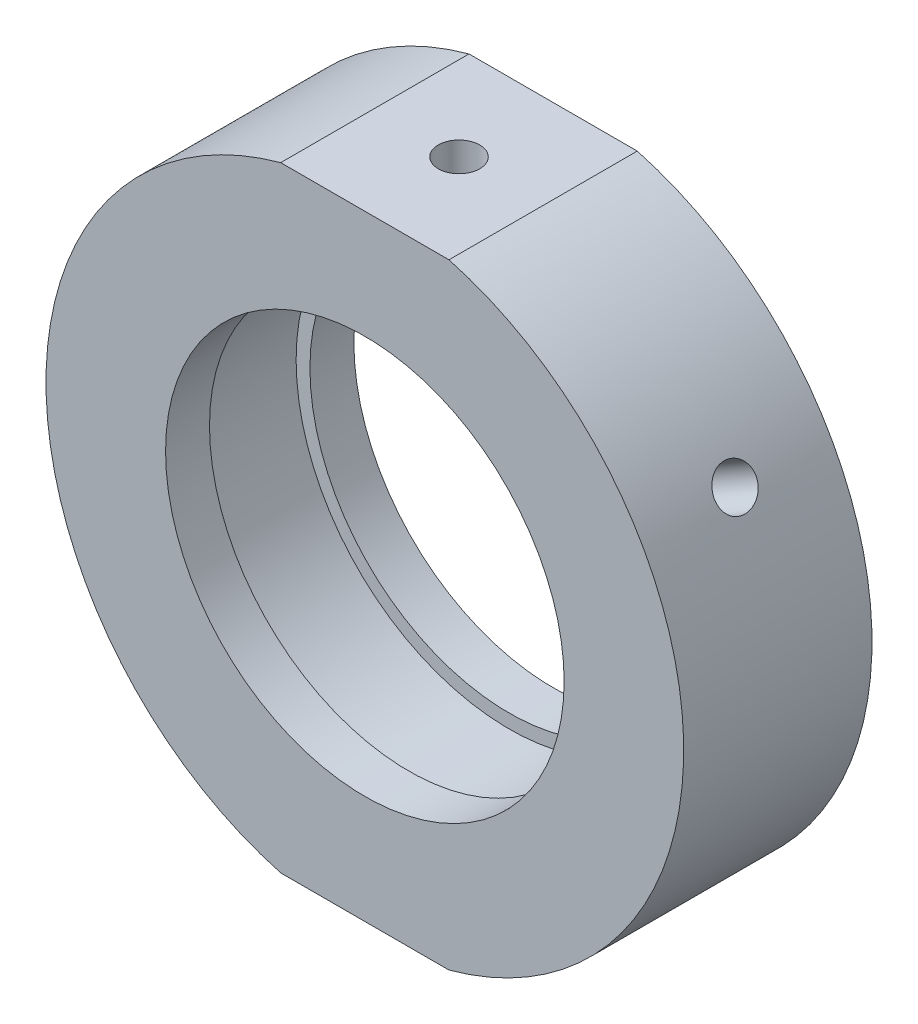
ISO-10303-21;
HEADER;
FILE_DESCRIPTION(('STEP AP214'),'2;1');
FILE_NAME('part.step','',(''),(''),'','','');
FILE_SCHEMA(('AUTOMOTIVE_DESIGN { 1 0 10303 214 1 1 1 1 }'));
ENDSEC;
DATA;
#1=APPLICATION_CONTEXT('core data for automotive mechanical design processes');
#2=APPLICATION_PROTOCOL_DEFINITION('international standard','automotive_design',2000,#1);
#3=PRODUCT_CONTEXT('',#1,'mechanical');
#4=PRODUCT('Part','Part','',(#3));
#5=PRODUCT_RELATED_PRODUCT_CATEGORY('part','',(#4));
#6=PRODUCT_DEFINITION_FORMATION('','',#4);
#7=PRODUCT_DEFINITION_CONTEXT('part definition',#1,'design');
#8=PRODUCT_DEFINITION('design','',#6,#7);
#9=PRODUCT_DEFINITION_SHAPE('','',#8);
#10=(LENGTH_UNIT() NAMED_UNIT(*) SI_UNIT(.MILLI.,.METRE.));
#11=(NAMED_UNIT(*) PLANE_ANGLE_UNIT() SI_UNIT($,.RADIAN.));
#12=(NAMED_UNIT(*) SI_UNIT($,.STERADIAN.) SOLID_ANGLE_UNIT());
#13=UNCERTAINTY_MEASURE_WITH_UNIT(LENGTH_MEASURE(1.E-05),#10,'distance_accuracy_value','');
#14=(GEOMETRIC_REPRESENTATION_CONTEXT(3) GLOBAL_UNCERTAINTY_ASSIGNED_CONTEXT((#13)) GLOBAL_UNIT_ASSIGNED_CONTEXT((#10,
#11,#12)) REPRESENTATION_CONTEXT('',''));
#15=CARTESIAN_POINT('',(0.,0.,0.));
#16=DIRECTION('',(0.,0.,1.));
#17=DIRECTION('',(1.,0.,0.));
#18=AXIS2_PLACEMENT_3D('',#15,#16,#17);
#19=CARTESIAN_POINT('',(0.,0.,-31.9390681003584));
#20=DIRECTION('',(0.,0.,-1.));
#21=DIRECTION('',(-1.,0.,0.));
#22=AXIS2_PLACEMENT_3D('',#19,#20,#21);
#23=CYLINDRICAL_SURFACE('',#22,25.4);
#24=CARTESIAN_POINT('',(21.1255837052229,14.1021173273243,0.));
#25=CARTESIAN_POINT('',(21.1255863615312,14.1021141605083,-0.092576256315231));
#26=CARTESIAN_POINT('',(21.1299363854258,14.0956035641206,-0.18521714935843));
#27=CARTESIAN_POINT('',(21.1471903326474,14.0697041126058,-0.367940352830904));
#28=CARTESIAN_POINT('',(21.1601041850746,14.0503003087446,-0.458019566611404));
#29=CARTESIAN_POINT('',(21.1940041030208,13.9991116481198,-0.632946226853724));
#30=CARTESIAN_POINT('',(21.2149858749936,13.9673333766262,-0.71779642824638));
#31=CARTESIAN_POINT('',(21.2642526004663,13.8922125376661,-0.879890058522677));
#32=CARTESIAN_POINT('',(21.292535893129,13.8488725999941,-0.957135211772866));
#33=CARTESIAN_POINT('',(21.3554466990147,13.7516632788366,-1.1019726091419));
#34=CARTESIAN_POINT('',(21.3900831871358,13.6977789924932,-1.1695509539082));
#35=CARTESIAN_POINT('',(21.4644736584157,13.5809115475335,-1.29301742319575));
#36=CARTESIAN_POINT('',(21.5042278559428,13.5179280077581,-1.3489050577641));
#37=CARTESIAN_POINT('',(21.5875527489257,13.3844593266428,-1.44744666643091));
#38=CARTESIAN_POINT('',(21.631126729652,13.3139677164302,-1.49008910270414));
#39=CARTESIAN_POINT('',(21.7206441675858,13.1674212213743,-1.56085598399379));
#40=CARTESIAN_POINT('',(21.7665875977651,13.0913663999864,-1.58898059457471));
#41=CARTESIAN_POINT('',(21.8593422054505,12.9358933258085,-1.62987480068591));
#42=CARTESIAN_POINT('',(21.906152053296,12.8564800197265,-1.64266621735386));
#43=CARTESIAN_POINT('',(21.9993099582266,12.6964142499021,-1.65259832827393));
#44=CARTESIAN_POINT('',(22.0456580208599,12.6157618010774,-1.64973921079273));
#45=CARTESIAN_POINT('',(22.1365174445638,12.4556436472342,-1.62846939769357));
#46=CARTESIAN_POINT('',(22.1810314715213,12.3761763351589,-1.61008217447344));
#47=CARTESIAN_POINT('',(22.2671217856854,12.2206054060558,-1.55831452801674));
#48=CARTESIAN_POINT('',(22.3086980544109,12.1445018101899,-1.52493401046853));
#49=CARTESIAN_POINT('',(22.3879172153119,11.9978382471997,-1.4441007901877));
#50=CARTESIAN_POINT('',(22.4255571087251,11.9272825164906,-1.39663746316395));
#51=CARTESIAN_POINT('',(22.4960021791464,11.7938791572256,-1.28899366150814));
#52=CARTESIAN_POINT('',(22.5288072972254,11.7310316226231,-1.22881303189206));
#53=CARTESIAN_POINT('',(22.588934021688,11.6148335001785,-1.09731039334049));
#54=CARTESIAN_POINT('',(22.6162453867024,11.5615006700455,-1.02596800882872));
#55=CARTESIAN_POINT('',(22.6647552962459,11.4661126921603,-0.874238356232138));
#56=CARTESIAN_POINT('',(22.685953838128,11.4240575492918,-0.793851084230694));
#57=CARTESIAN_POINT('',(22.7218310998525,11.3525327799725,-0.626300386389155));
#58=CARTESIAN_POINT('',(22.736509412598,11.3230639393646,-0.53913653784588));
#59=CARTESIAN_POINT('',(22.7590714641954,11.2776466843304,-0.360513015415985));
#60=CARTESIAN_POINT('',(22.7669552894322,11.2616980980085,-0.269053396161131));
#61=CARTESIAN_POINT('',(22.7757773944076,11.2438456563849,-0.084613406643308));
#62=CARTESIAN_POINT('',(22.7767283360383,11.2419161972317,0.00836388027156324));
#63=CARTESIAN_POINT('',(22.7717010905697,11.2520958233832,0.193357145884924));
#64=CARTESIAN_POINT('',(22.7657229424632,11.2642048296879,0.285373129990113));
#65=CARTESIAN_POINT('',(22.7469535565592,11.302059325108,0.465751060044093));
#66=CARTESIAN_POINT('',(22.7341682048513,11.3277930330357,0.554116091891322));
#67=CARTESIAN_POINT('',(22.7020224111887,11.3920789365367,0.72477904114321));
#68=CARTESIAN_POINT('',(22.6826619048223,11.4306312576839,0.807076899102928));
#69=CARTESIAN_POINT('',(22.6376996378619,11.5194194964734,0.96340024846482));
#70=CARTESIAN_POINT('',(22.6120888762405,11.5696722591463,1.0374135830307));
#71=CARTESIAN_POINT('',(22.5551499391607,11.6802855429439,1.17494441291504));
#72=CARTESIAN_POINT('',(22.5238217033653,11.7406461707372,1.2384617974554));
#73=CARTESIAN_POINT('',(22.4560577971483,11.8697422229493,1.35329408810745));
#74=CARTESIAN_POINT('',(22.419614533366,11.93849007816,1.4045905409198));
#75=CARTESIAN_POINT('',(22.3424817952513,12.0822245712966,1.49339854031989));
#76=CARTESIAN_POINT('',(22.3017923488145,12.1572111682362,1.53091017746014));
#77=CARTESIAN_POINT('',(22.2171899924813,12.3111400494117,1.59105167185681));
#78=CARTESIAN_POINT('',(22.1732796363469,12.3900791843691,1.6136931803907));
#79=CARTESIAN_POINT('',(22.0833510532279,12.5496609908419,1.64348983344682));
#80=CARTESIAN_POINT('',(22.0373328489618,12.6303036439917,1.6506451448404));
#81=CARTESIAN_POINT('',(21.9445519782846,12.7908255022556,1.64926464318743));
#82=CARTESIAN_POINT('',(21.8977908385922,12.8707058396567,1.64075769659949));
#83=CARTESIAN_POINT('',(21.8048098503978,13.0276086425459,1.60835404670283));
#84=CARTESIAN_POINT('',(21.7585900028295,13.1046311031043,1.584457316849));
#85=CARTESIAN_POINT('',(21.6681118736425,13.2536989678976,1.52195905008008));
#86=CARTESIAN_POINT('',(21.6238535702055,13.3257444274968,1.48335767677136));
#87=CARTESIAN_POINT('',(21.5387155385461,13.4629216075301,1.39254977966906));
#88=CARTESIAN_POINT('',(21.4978357262853,13.5280534999474,1.34034359442331));
#89=CARTESIAN_POINT('',(21.420742973893,13.6497978206802,1.22370103592581));
#90=CARTESIAN_POINT('',(21.3845382072521,13.7063953563964,1.15924371720355));
#91=CARTESIAN_POINT('',(21.3181153252652,13.809479721239,1.0199581955059));
#92=CARTESIAN_POINT('',(21.2878986755489,13.8559640753715,0.945127461168909));
#93=CARTESIAN_POINT('',(21.2344988622279,13.937663029851,0.787127696262785));
#94=CARTESIAN_POINT('',(21.2113249285851,13.9728628443212,0.703947911881443));
#95=CARTESIAN_POINT('',(21.1729283497024,14.0309775009916,0.531749358735033));
#96=CARTESIAN_POINT('',(21.1576964096522,14.0539067047765,0.442737553421856));
#97=CARTESIAN_POINT('',(21.1396971044625,14.0809571867969,0.294319263500426));
#98=CARTESIAN_POINT('',(21.1344131421564,14.0888829299295,0.235871694983986));
#99=CARTESIAN_POINT('',(21.1273555964686,14.0994640080415,0.118291548613022));
#100=CARTESIAN_POINT('',(21.1255820077632,14.1021193510136,0.0591589717974798));
#101=CARTESIAN_POINT('',(21.1255837052229,14.1021173273243,0.));
#102=B_SPLINE_CURVE_WITH_KNOTS('',3,(#24,#25,#26,#27,#28,#29,#30,#31,#32,#33,#34,#35,#36,#37,
#38,#39,#40,#41,#42,#43,#44,#45,#46,#47,#48,#49,#50,#51,#52,#53,#54,#55,#56,#57,#58,#59,#60,#61,
#62,#63,#64,#65,#66,#67,#68,#69,#70,#71,#72,#73,#74,#75,#76,#77,#78,#79,#80,#81,#82,#83,#84,#85,
#86,#87,#88,#89,#90,#91,#92,#93,#94,#95,#96,#97,#98,#99,#100,#101),.UNSPECIFIED.,.T.,.F.,(4,2,2,
2,2,2,2,2,2,2,2,2,2,2,2,2,2,2,2,2,2,2,2,2,2,2,2,2,2,2,2,2,2,2,2,2,2,2,4),(0.,0.277512798480436,
0.55534791555879,0.833035379869694,1.11065973569114,1.38867934350629,1.66671060067618,
1.94498337461715,2.22325297500384,2.50112608945465,2.77899586126354,3.05644635337373,
3.33389859074277,3.61156067692887,3.88922614713995,4.16740453539095,4.44558304409998,
4.72377891872058,5.00197125632302,5.27965538897225,5.55733795898812,5.83478080996282,
6.11222637890522,6.39007388121361,6.66792431583895,6.94619167560211,7.22445720739304,
7.50250444724585,7.78054869098884,8.05808099582016,8.33561377935525,8.61314347510357,
8.89066626534621,9.16866786858889,9.44673743068538,9.7251698658511,10.0032757055969,
10.1806148784034,10.3579537822671),.UNSPECIFIED.);
#103=CARTESIAN_POINT('',(21.1255837052229,14.1021173273243,0.));
#104=VERTEX_POINT('',#103);
#105=EDGE_CURVE('E13',#104,#104,#102,.T.);
#106=ORIENTED_EDGE('',*,*,#105,.T.);
#107=EDGE_LOOP('',(#106));
#108=FACE_BOUND('',#107,.T.);
#109=CARTESIAN_POINT('',(0.,0.,7.49999999999999));
#110=DIRECTION('',(0.,0.,-1.));
#111=DIRECTION('',(-1.,0.,0.));
#112=AXIS2_PLACEMENT_3D('',#109,#110,#111);
#113=CIRCLE('',#112,25.4);
#114=CARTESIAN_POINT('',(6.70149237110661,24.5,7.5));
#115=VERTEX_POINT('',#114);
#116=CARTESIAN_POINT('',(6.70149237110661,-24.5,7.49999999999999));
#117=VERTEX_POINT('',#116);
#118=EDGE_CURVE('E158',#115,#117,#113,.T.);
#119=ORIENTED_EDGE('',*,*,#118,.T.);
#120=DIRECTION('',(0.,0.,-1.));
#121=VECTOR('',#120,1.);
#122=CARTESIAN_POINT('',(6.70149237110663,-24.5,-31.9390681003584));
#123=LINE('',#122,#121);
#124=CARTESIAN_POINT('',(6.7014923711066,-24.5,-7.5));
#125=VERTEX_POINT('',#124);
#126=EDGE_CURVE('E71',#117,#125,#123,.T.);
#127=ORIENTED_EDGE('',*,*,#126,.T.);
#128=CARTESIAN_POINT('',(0.,0.,-7.5));
#129=DIRECTION('',(0.,0.,-1.));
#130=DIRECTION('',(-1.,0.,0.));
#131=AXIS2_PLACEMENT_3D('',#128,#129,#130);
#132=CIRCLE('',#131,25.4);
#133=CARTESIAN_POINT('',(6.70149237110663,24.5,-7.5));
#134=VERTEX_POINT('',#133);
#135=EDGE_CURVE('E162',#134,#125,#132,.T.);
#136=ORIENTED_EDGE('',*,*,#135,.F.);
#137=DIRECTION('',(0.,0.,-1.));
#138=VECTOR('',#137,1.);
#139=CARTESIAN_POINT('',(6.70149237110663,24.5,-31.9390681003584));
#140=LINE('',#139,#138);
#141=EDGE_CURVE('E132',#134,#115,#140,.F.);
#142=ORIENTED_EDGE('',*,*,#141,.T.);
#143=EDGE_LOOP('',(#119,#127,#136,#142));
#144=FACE_BOUND('',#143,.T.);
#145=ADVANCED_FACE('F51',(#108,#144),#23,.T.);
#146=CARTESIAN_POINT('',(15.875,0.,-7.5));
#147=DIRECTION('',(0.,0.,1.));
#148=DIRECTION('',(1.,0.,0.));
#149=AXIS2_PLACEMENT_3D('',#146,#147,#148);
#150=PLANE('',#149);
#151=CARTESIAN_POINT('',(0.,0.,-7.5));
#152=DIRECTION('',(0.,0.,-1.));
#153=DIRECTION('',(-1.,0.,0.));
#154=AXIS2_PLACEMENT_3D('',#151,#152,#153);
#155=CIRCLE('',#154,15.875);
#156=CARTESIAN_POINT('',(-15.875,0.,-7.49999999999999));
#157=VERTEX_POINT('',#156);
#158=EDGE_CURVE('E140',#157,#157,#155,.T.);
#159=ORIENTED_EDGE('',*,*,#158,.F.);
#160=EDGE_LOOP('',(#159));
#161=FACE_BOUND('',#160,.T.);
#162=ORIENTED_EDGE('',*,*,#135,.T.);
#163=DIRECTION('',(-1.,0.,0.));
#164=VECTOR('',#163,1.);
#165=CARTESIAN_POINT('',(15.875,-24.5,-7.5));
#166=LINE('',#165,#164);
#167=CARTESIAN_POINT('',(-6.70149237110662,-24.5,-7.5));
#168=VERTEX_POINT('',#167);
#169=EDGE_CURVE('E128',#125,#168,#166,.T.);
#170=ORIENTED_EDGE('',*,*,#169,.T.);
#171=CARTESIAN_POINT('',(-6.70149237110659,24.5,-7.5));
#172=VERTEX_POINT('',#171);
#173=EDGE_CURVE('E161',#168,#172,#132,.T.);
#174=ORIENTED_EDGE('',*,*,#173,.T.);
#175=DIRECTION('',(1.,0.,0.));
#176=VECTOR('',#175,1.);
#177=CARTESIAN_POINT('',(15.875,24.5,-7.5));
#178=LINE('',#177,#176);
#179=EDGE_CURVE('E135',#172,#134,#178,.T.);
#180=ORIENTED_EDGE('',*,*,#179,.T.);
#181=EDGE_LOOP('',(#162,#170,#174,#180));
#182=FACE_BOUND('',#181,.T.);
#183=ADVANCED_FACE('F53',(#161,#182),#150,.F.);
#184=CARTESIAN_POINT('',(-22.7755837052229,11.2442334948357,0.));
#185=CARTESIAN_POINT('',(-22.7755822908339,11.2442373786741,-0.092576256315231));
#186=CARTESIAN_POINT('',(-22.7721189609157,11.2512599080678,-0.18521714935843));
#187=CARTESIAN_POINT('',(-22.7583163515706,11.2791519904346,-0.367940352830904));
#188=CARTESIAN_POINT('',(-22.7479690907104,11.3000376166279,-0.458019566611404));
#189=CARTESIAN_POINT('',(-22.7205883691967,11.354990137068,-0.632946226853724));
#190=CARTESIAN_POINT('',(-22.7035584647813,11.3890500203596,-0.71779642824638));
#191=CARTESIAN_POINT('',(-22.6631352726245,11.4692766756603,-0.879890058522676));
#192=CARTESIAN_POINT('',(-22.6397434319336,11.5154406944448,-0.957135211772865));
#193=CARTESIAN_POINT('',(-22.5870130932694,11.6185277110932,-1.1019726091419));
#194=CARTESIAN_POINT('',(-22.5576661764917,11.6754659328756,-1.1695509539082));
#195=CARTESIAN_POINT('',(-22.4936512359212,11.7983236932834,-1.29301742319575));
#196=CARTESIAN_POINT('',(-22.458982989219,11.8642436081366,-1.3489050577641));
#197=CARTESIAN_POINT('',(-22.3850581672549,12.0031394227851,-1.44744666643091));
#198=CARTESIAN_POINT('',(-22.3457976324203,12.0761214021443,-1.49008910270414));
#199=CARTESIAN_POINT('',(-22.2636433638333,12.2269190250047,-1.56085598399379));
#200=CARTESIAN_POINT('',(-22.2207496715207,12.3047346133709,-1.5889805945747));
#201=CARTESIAN_POINT('',(-22.1324833435209,12.4627989970334,-1.62987480068591));
#202=CARTESIAN_POINT('',(-22.0871143269781,12.543044167456,-1.64266621735386));
#203=CARTESIAN_POINT('',(-21.9950722564991,12.7037541646014,-1.65259832827393));
#204=CARTESIAN_POINT('',(-21.9483992182562,12.7842189886703,-1.64973921079273));
#205=CARTESIAN_POINT('',(-21.8551625412728,12.9429646346928,-1.62846939769357));
#206=CARTESIAN_POINT('',(-21.8085988437239,13.0212485689004,-1.61008217447344));
#207=CARTESIAN_POINT('',(-21.7169156241123,13.1735904325378,-1.55831452801674));
#208=CARTESIAN_POINT('',(-21.6717961111359,13.2476483353816,-1.52493401046853));
#209=CARTESIAN_POINT('',(-21.5843913202273,13.3895859226834,-1.4441007901877));
#210=CARTESIAN_POINT('',(-21.5421082117573,13.4574608919296,-1.39663746316395));
#211=CARTESIAN_POINT('',(-21.4618000488942,13.5851697921183,-1.28899366150814));
#212=CARTESIAN_POINT('',(-21.4237750464028,13.6450036250501,-1.22881303189206));
#213=CARTESIAN_POINT('',(-21.353207882725,13.7551739571033,-1.09731039334049));
#214=CARTESIAN_POINT('',(-21.3206759794812,13.8054927080844,-1.02596800882871));
#215=CARTESIAN_POINT('',(-21.2623225221888,13.8951975110269,-0.874238356232137));
#216=CARTESIAN_POINT('',(-21.2365009710459,13.9345835582543,-0.793851084230694));
#217=CARTESIAN_POINT('',(-21.1924973346779,14.0014165629856,-0.626300386389155));
#218=CARTESIAN_POINT('',(-21.174315726464,14.0288627750118,-0.53913653784588));
#219=CARTESIAN_POINT('',(-21.146264255633,14.0711107123737,-0.360513015415985));
#220=CARTESIAN_POINT('',(-21.1363942873422,14.0859125984687,-0.269053396161131));
#221=CARTESIAN_POINT('',(-21.1253446718643,14.1024789863041,-0.0846134066433075));
#222=CARTESIAN_POINT('',(-21.1241491820374,14.1042672554904,0.00836388027156358));
#223=CARTESIAN_POINT('',(-21.1304513741514,14.0948237201277,0.193357145884924));
#224=CARTESIAN_POINT('',(-21.1379490071725,14.0835919888476,0.285373129990113));
#225=CARTESIAN_POINT('',(-21.1613472689018,14.0484099761313,0.465751060044092));
#226=CARTESIAN_POINT('',(-21.1772406378468,14.0244706827921,0.554116091891321));
#227=CARTESIAN_POINT('',(-21.2168409665526,13.9644886571049,0.724779041143209));
#228=CARTESIAN_POINT('',(-21.2405480028578,13.9284458061879,0.807076899102927));
#229=CARTESIAN_POINT('',(-21.2949597397265,13.8451132213937,0.96340024846482));
#230=CARTESIAN_POINT('',(-21.3256745280009,13.7978072698828,1.0374135830307));
#231=CARTESIAN_POINT('',(-21.3929989732258,13.6931900620084,1.17494441291504));
#232=CARTESIAN_POINT('',(-21.4296086923854,13.6358787000572,1.2384617974554));
#233=CARTESIAN_POINT('',(-21.5075272000209,13.5126454097076,1.35329408810745));
#234=CARTESIAN_POINT('',(-21.5488429571979,13.4467106898699,1.4045905409198));
#235=CARTESIAN_POINT('',(-21.6347543105969,13.3080445326309,1.49339854031989));
#236=CARTESIAN_POINT('',(-21.6793498852716,13.2353131398808,1.53091017746014));
#237=CARTESIAN_POINT('',(-21.7703550285791,13.0850809094885,1.59105167185681));
#238=CARTESIAN_POINT('',(-21.8167631467377,13.0075838581083,1.6136931803907));
#239=CARTESIAN_POINT('',(-21.9100007535655,12.8499125173645,1.64348983344682));
#240=CARTESIAN_POINT('',(-21.9568302376888,12.7697382568586,1.6506451448404));
#241=CARTESIAN_POINT('',(-22.0494558094694,12.6091267367349,1.64926464318743));
#242=CARTESIAN_POINT('',(-22.0952536410754,12.5286902331509,1.64075769659949));
#243=CARTESIAN_POINT('',(-22.1846449602052,12.3697149338609,1.60835404670283));
#244=CARTESIAN_POINT('',(-22.2282384439266,12.2911761414285,1.584457316849));
#245=CARTESIAN_POINT('',(-22.312095937132,12.138285850669,1.52195905008008));
#246=CARTESIAN_POINT('',(-22.3523599836538,12.0639343057646,1.48335767677136));
#247=CARTESIAN_POINT('',(-22.4285898905524,11.9216140175027,1.39254977966906));
#248=CARTESIAN_POINT('',(-22.464555857852,11.8536451153743,1.34034359442331));
#249=CARTESIAN_POINT('',(-22.5314431561769,11.7260086729885,1.22370103592581));
#250=CARTESIAN_POINT('',(-22.5623556765783,11.6663556574813,1.15924371720355));
#251=CARTESIAN_POINT('',(-22.6184179142715,11.5572895718667,1.0199581955059));
#252=CARTESIAN_POINT('',(-22.6435662209706,11.5078790085289,0.945127461168905));
#253=CARTESIAN_POINT('',(-22.687619684352,11.4207839363958,0.787127696262782));
#254=CARTESIAN_POINT('',(-22.7065166510703,11.3831148139204,0.703947911881439));
#255=CARTESIAN_POINT('',(-22.7376471306378,11.3208050728544,0.531749358735031));
#256=CARTESIAN_POINT('',(-22.7498884335789,11.2961492239296,0.442737553421854));
#257=CARTESIAN_POINT('',(-22.7643151855984,11.2670361273747,0.294319263500426));
#258=CARTESIAN_POINT('',(-22.768537099342,11.2584972102186,0.235871694983987));
#259=CARTESIAN_POINT('',(-22.7741718089425,11.2470946573086,0.118291548613023));
#260=CARTESIAN_POINT('',(-22.7755846090594,11.2442310129478,0.0591589717974802));
#261=CARTESIAN_POINT('',(-22.7755837052229,11.2442334948357,0.));
#262=B_SPLINE_CURVE_WITH_KNOTS('',3,(#184,#185,#186,#187,#188,#189,#190,#191,#192,#193,#194,
#195,#196,#197,#198,#199,#200,#201,#202,#203,#204,#205,#206,#207,#208,#209,#210,#211,#212,#213,
#214,#215,#216,#217,#218,#219,#220,#221,#222,#223,#224,#225,#226,#227,#228,#229,#230,#231,#232,
#233,#234,#235,#236,#237,#238,#239,#240,#241,#242,#243,#244,#245,#246,#247,#248,#249,#250,#251,
#252,#253,#254,#255,#256,#257,#258,#259,#260,#261),.UNSPECIFIED.,.T.,.F.,(4,2,2,2,2,2,2,2,2,2,2,
2,2,2,2,2,2,2,2,2,2,2,2,2,2,2,2,2,2,2,2,2,2,2,2,2,2,2,4),(0.,0.277512798480436,
0.555347915558791,0.833035379869695,1.11065973569114,1.38867934350629,1.66671060067618,
1.94498337461715,2.22325297500384,2.50112608945465,2.77899586126355,3.05644635337373,
3.33389859074277,3.61156067692887,3.88922614713995,4.16740453539095,4.44558304409998,
4.72377891872058,5.00197125632302,5.27965538897225,5.55733795898813,5.83478080996282,
6.11222637890522,6.39007388121361,6.66792431583895,6.94619167560211,7.22445720739303,
7.50250444724584,7.78054869098884,8.05808099582016,8.33561377935525,8.61314347510357,
8.89066626534621,9.16866786858889,9.44673743068539,9.7251698658511,10.0032757055969,
10.1806148784034,10.3579537822671),.UNSPECIFIED.);
#263=CARTESIAN_POINT('',(-22.7755837052229,11.2442334948357,0.));
#264=VERTEX_POINT('',#263);
#265=EDGE_CURVE('E186',#264,#264,#262,.T.);
#266=ORIENTED_EDGE('',*,*,#265,.T.);
#267=EDGE_LOOP('',(#266));
#268=FACE_BOUND('',#267,.T.);
#269=ORIENTED_EDGE('',*,*,#173,.F.);
#270=DIRECTION('',(0.,0.,-1.));
#271=VECTOR('',#270,1.);
#272=CARTESIAN_POINT('',(-6.70149237110663,-24.5,-31.9390681003584));
#273=LINE('',#272,#271);
#274=CARTESIAN_POINT('',(-6.7014923711066,-24.5,7.5));
#275=VERTEX_POINT('',#274);
#276=EDGE_CURVE('E126',#168,#275,#273,.F.);
#277=ORIENTED_EDGE('',*,*,#276,.T.);
#278=CARTESIAN_POINT('',(-6.7014923711066,24.5,7.49999999999999));
#279=VERTEX_POINT('',#278);
#280=EDGE_CURVE('E79',#275,#279,#113,.T.);
#281=ORIENTED_EDGE('',*,*,#280,.T.);
#282=DIRECTION('',(0.,0.,-1.));
#283=VECTOR('',#282,1.);
#284=CARTESIAN_POINT('',(-6.70149237110663,24.5,-31.9390681003584));
#285=LINE('',#284,#283);
#286=EDGE_CURVE('E138',#279,#172,#285,.T.);
#287=ORIENTED_EDGE('',*,*,#286,.T.);
#288=EDGE_LOOP('',(#269,#277,#281,#287));
#289=FACE_BOUND('',#288,.T.);
#290=ADVANCED_FACE('F171',(#268,#289),#23,.T.);
#291=CARTESIAN_POINT('',(25.4,0.,7.5));
#292=DIRECTION('',(0.,0.,-1.));
#293=DIRECTION('',(-1.,0.,0.));
#294=AXIS2_PLACEMENT_3D('',#291,#292,#293);
#295=PLANE('',#294);
#296=ORIENTED_EDGE('',*,*,#280,.F.);
#297=DIRECTION('',(1.,0.,0.));
#298=VECTOR('',#297,1.);
#299=CARTESIAN_POINT('',(25.4,-24.5,7.5));
#300=LINE('',#299,#298);
#301=EDGE_CURVE('E64',#275,#117,#300,.T.);
#302=ORIENTED_EDGE('',*,*,#301,.T.);
#303=ORIENTED_EDGE('',*,*,#118,.F.);
#304=DIRECTION('',(-1.,0.,0.));
#305=VECTOR('',#304,1.);
#306=CARTESIAN_POINT('',(25.4,24.5,7.5));
#307=LINE('',#306,#305);
#308=EDGE_CURVE('E165',#115,#279,#307,.T.);
#309=ORIENTED_EDGE('',*,*,#308,.T.);
#310=EDGE_LOOP('',(#296,#302,#303,#309));
#311=FACE_BOUND('',#310,.T.);
#312=CARTESIAN_POINT('',(0.,0.,7.5));
#313=DIRECTION('',(0.,0.,-1.));
#314=DIRECTION('',(-1.,0.,0.));
#315=AXIS2_PLACEMENT_3D('',#312,#313,#314);
#316=CIRCLE('',#315,15.875);
#317=CARTESIAN_POINT('',(-15.875,0.,7.5));
#318=VERTEX_POINT('',#317);
#319=EDGE_CURVE('E155',#318,#318,#316,.T.);
#320=ORIENTED_EDGE('',*,*,#319,.T.);
#321=EDGE_LOOP('',(#320));
#322=FACE_BOUND('',#321,.T.);
#323=ADVANCED_FACE('F204',(#311,#322),#295,.F.);
#324=CARTESIAN_POINT('',(0.,0.,-31.9390681003584));
#325=DIRECTION('',(0.,0.,-1.));
#326=DIRECTION('',(-1.,0.,0.));
#327=AXIS2_PLACEMENT_3D('',#324,#325,#326);
#328=CYLINDRICAL_SURFACE('',#327,15.875);
#329=ORIENTED_EDGE('',*,*,#319,.F.);
#330=EDGE_LOOP('',(#329));
#331=FACE_BOUND('',#330,.T.);
#332=CARTESIAN_POINT('',(0.,0.,4.));
#333=DIRECTION('',(0.,0.,-1.));
#334=DIRECTION('',(-1.,0.,0.));
#335=AXIS2_PLACEMENT_3D('',#332,#333,#334);
#336=CIRCLE('',#335,15.875);
#337=CARTESIAN_POINT('',(-15.875,0.,4.));
#338=VERTEX_POINT('',#337);
#339=EDGE_CURVE('E152',#338,#338,#336,.T.);
#340=ORIENTED_EDGE('',*,*,#339,.T.);
#341=EDGE_LOOP('',(#340));
#342=FACE_BOUND('',#341,.T.);
#343=ADVANCED_FACE('F201',(#331,#342),#328,.F.);
#344=CARTESIAN_POINT('',(15.875,0.,4.));
#345=DIRECTION('',(0.,0.,1.));
#346=DIRECTION('',(1.,0.,0.));
#347=AXIS2_PLACEMENT_3D('',#344,#345,#346);
#348=PLANE('',#347);
#349=ORIENTED_EDGE('',*,*,#339,.F.);
#350=EDGE_LOOP('',(#349));
#351=FACE_BOUND('',#350,.T.);
#352=CARTESIAN_POINT('',(0.,0.,4.));
#353=DIRECTION('',(0.,0.,-1.));
#354=DIRECTION('',(-1.,0.,0.));
#355=AXIS2_PLACEMENT_3D('',#352,#353,#354);
#356=CIRCLE('',#355,16.975);
#357=CARTESIAN_POINT('',(-16.975,0.,4.));
#358=VERTEX_POINT('',#357);
#359=EDGE_CURVE('E149',#358,#358,#356,.T.);
#360=ORIENTED_EDGE('',*,*,#359,.T.);
#361=EDGE_LOOP('',(#360));
#362=FACE_BOUND('',#361,.T.);
#363=ADVANCED_FACE('F195',(#351,#362),#348,.F.);
#364=CARTESIAN_POINT('',(0.,0.,-31.9390681003584));
#365=DIRECTION('',(0.,0.,-1.));
#366=DIRECTION('',(-1.,0.,0.));
#367=AXIS2_PLACEMENT_3D('',#364,#365,#366);
#368=CYLINDRICAL_SURFACE('',#367,16.975);
#369=CARTESIAN_POINT('',(-15.4561685708968,7.01836719672185,0.));
#370=CARTESIAN_POINT('',(-15.4561674795785,7.01837119809081,0.0924460358637891));
#371=CARTESIAN_POINT('',(-15.4529350311262,7.02550177648189,0.184953524271149));
#372=CARTESIAN_POINT('',(-15.4400339349701,7.05380816834611,0.367404644242962));
#373=CARTESIAN_POINT('',(-15.4303581581889,7.07499953897605,0.45734532073786));
#374=CARTESIAN_POINT('',(-15.4046914043663,7.13071123103748,0.631994170208551));
#375=CARTESIAN_POINT('',(-15.3887042109307,7.16522356646168,0.716705443019642));
#376=CARTESIAN_POINT('',(-15.350627046165,7.24643885921021,0.878548575935681));
#377=CARTESIAN_POINT('',(-15.3285383035552,7.29313936199632,0.95568195782909));
#378=CARTESIAN_POINT('',(-15.2784957418457,7.39740068644304,1.10046401838794));
#379=CARTESIAN_POINT('',(-15.2505241791438,7.45499430948171,1.16808294588381));
#380=CARTESIAN_POINT('',(-15.1892078240735,7.57914070317203,1.29166055792703));
#381=CARTESIAN_POINT('',(-15.1558627880103,7.64569388013006,1.34761871337722));
#382=CARTESIAN_POINT('',(-15.0843429741025,7.78584704913896,1.44638855509568));
#383=CARTESIAN_POINT('',(-15.0461587683665,7.85946072680085,1.48917400413159));
#384=CARTESIAN_POINT('',(-14.9658194691904,8.01138242252531,1.56021606491202));
#385=CARTESIAN_POINT('',(-14.9236644676315,8.08969033195177,1.5884730127371));
#386=CARTESIAN_POINT('',(-14.836530683038,8.24840272396984,1.62956895975003));
#387=CARTESIAN_POINT('',(-14.7915613070394,8.32879974663584,1.64245670780161));
#388=CARTESIAN_POINT('',(-14.6998714184018,8.48957995537193,1.65259923223923));
#389=CARTESIAN_POINT('',(-14.6531509488798,8.56996314173382,1.64985439329462));
#390=CARTESIAN_POINT('',(-14.5594733354019,8.72816052822291,1.62884928547987));
#391=CARTESIAN_POINT('',(-14.512517523264,8.80598248624426,1.61064143683254));
#392=CARTESIAN_POINT('',(-14.4196676895802,8.95721426464572,1.55930879943896));
#393=CARTESIAN_POINT('',(-14.3737736811791,9.03062403042163,1.52618382612511));
#394=CARTESIAN_POINT('',(-14.2844812923172,9.17121439100433,1.44589958863717));
#395=CARTESIAN_POINT('',(-14.2410871889745,9.23838442376339,1.39871707722609));
#396=CARTESIAN_POINT('',(-14.1583781236576,9.36464946753592,1.29167398188222));
#397=CARTESIAN_POINT('',(-14.1190632747138,9.42374425481017,1.23181304678799));
#398=CARTESIAN_POINT('',(-14.0457830793002,9.53262485982912,1.10081741060727));
#399=CARTESIAN_POINT('',(-14.0118405241704,9.58237117641101,1.02963711804075));
#400=CARTESIAN_POINT('',(-13.9507912007046,9.67103701608634,0.878181531727664));
#401=CARTESIAN_POINT('',(-13.9236844414099,9.7099565248599,0.797906225951941));
#402=CARTESIAN_POINT('',(-13.8773710583936,9.77603365013845,0.630504833100122));
#403=CARTESIAN_POINT('',(-13.8581659637242,9.8031889902113,0.543377423954368));
#404=CARTESIAN_POINT('',(-13.8284466185458,9.84506751597743,0.364762000432686));
#405=CARTESIAN_POINT('',(-13.8179321181678,9.85979105910556,0.273274111507714));
#406=CARTESIAN_POINT('',(-13.8060554020302,9.87641459114902,0.0889348596721392));
#407=CARTESIAN_POINT('',(-13.804655971794,9.87836672258394,-0.00390940610426158));
#408=CARTESIAN_POINT('',(-13.8109686880388,9.86953885403531,-0.188677191006075));
#409=CARTESIAN_POINT('',(-13.8186807183154,9.85875901643104,-0.280600721859154));
#410=CARTESIAN_POINT('',(-13.842871844845,9.82476225942691,-0.460732309118607));
#411=CARTESIAN_POINT('',(-13.8593335394367,9.80157002563567,-0.54894736660106));
#412=CARTESIAN_POINT('',(-13.9003452621319,9.74332017217178,-0.719375393004217));
#413=CARTESIAN_POINT('',(-13.9248954655815,9.70826229527018,-0.801588231759039));
#414=CARTESIAN_POINT('',(-13.9812078076748,9.62698789882404,-0.957968945877156));
#415=CARTESIAN_POINT('',(-14.0129929198233,9.5807358032341,-1.03211005721145));
#416=CARTESIAN_POINT('',(-14.0825152223566,9.47824953802466,-1.1699714804424));
#417=CARTESIAN_POINT('',(-14.1202525519557,9.42201513492849,-1.23369154853378));
#418=CARTESIAN_POINT('',(-14.2004291620293,9.30073806130375,-1.34912159213929));
#419=CARTESIAN_POINT('',(-14.2428839913561,9.23566609564929,-1.40079000103761));
#420=CARTESIAN_POINT('',(-14.3308847665201,9.098516159759,-1.49036416634794));
#421=CARTESIAN_POINT('',(-14.376430672032,9.02643828091495,-1.52827010226016));
#422=CARTESIAN_POINT('',(-14.4689946408248,8.87730262886373,-1.58917270829971));
#423=CARTESIAN_POINT('',(-14.5160100722985,8.80025352178912,-1.61219459201973));
#424=CARTESIAN_POINT('',(-14.6100856235806,8.64317072676717,-1.64275789621676));
#425=CARTESIAN_POINT('',(-14.6571457421742,8.56313711780314,-1.65029972606981));
#426=CARTESIAN_POINT('',(-14.749716626093,8.40267986203087,-1.64968326279111));
#427=CARTESIAN_POINT('',(-14.7952329771662,8.32225918181227,-1.64158954270418));
#428=CARTESIAN_POINT('',(-14.883683226882,8.16302009860795,-1.61006700105665));
#429=CARTESIAN_POINT('',(-14.9266171231981,8.08420169706569,-1.58663816568163));
#430=CARTESIAN_POINT('',(-15.0088453121939,7.93049745020929,-1.52512808469331));
#431=CARTESIAN_POINT('',(-15.0481400418934,7.85561113316828,-1.48704860128386));
#432=CARTESIAN_POINT('',(-15.1222418190763,7.71200134810673,-1.39732511536247));
#433=CARTESIAN_POINT('',(-15.1570489008148,7.64327783304556,-1.34568121639946));
#434=CARTESIAN_POINT('',(-15.2216404250025,7.5138239678451,-1.23005260405735));
#435=CARTESIAN_POINT('',(-15.2514044372991,7.45312633974573,-1.16601984291451));
#436=CARTESIAN_POINT('',(-15.3052462279346,7.34192689195529,-1.02752482972062));
#437=CARTESIAN_POINT('',(-15.3293226378513,7.2914275263628,-0.95306007461034));
#438=CARTESIAN_POINT('',(-15.3714716808479,7.2021478867004,-0.795619195504551));
#439=CARTESIAN_POINT('',(-15.3895296440883,7.16339626798711,-0.712622910493265));
#440=CARTESIAN_POINT('',(-15.4193019538639,7.0990858306231,-0.540674428999734));
#441=CARTESIAN_POINT('',(-15.431023481156,7.07351207971754,-0.451729103308774));
#442=CARTESIAN_POINT('',(-15.4450558523874,7.04280070774457,-0.301896883763632));
#443=CARTESIAN_POINT('',(-15.4492202717309,7.03365222735191,-0.241968978436047));
#444=CARTESIAN_POINT('',(-15.4547769838355,7.02143417011599,-0.121369544084109));
#445=CARTESIAN_POINT('',(-15.4561692874322,7.01836456951168,-0.0606980179673454));
#446=CARTESIAN_POINT('',(-15.4561685708968,7.01836719672185,0.));
#447=B_SPLINE_CURVE_WITH_KNOTS('',3,(#369,#370,#371,#372,#373,#374,#375,#376,#377,#378,#379,
#380,#381,#382,#383,#384,#385,#386,#387,#388,#389,#390,#391,#392,#393,#394,#395,#396,#397,#398,
#399,#400,#401,#402,#403,#404,#405,#406,#407,#408,#409,#410,#411,#412,#413,#414,#415,#416,#417,
#418,#419,#420,#421,#422,#423,#424,#425,#426,#427,#428,#429,#430,#431,#432,#433,#434,#435,#436,
#437,#438,#439,#440,#441,#442,#443,#444,#445,#446),.UNSPECIFIED.,.T.,.F.,(4,2,2,2,2,2,2,2,2,2,2,
2,2,2,2,2,2,2,2,2,2,2,2,2,2,2,2,2,2,2,2,2,2,2,2,2,2,2,4),(0.,0.277116456188804,
0.554540032278753,0.831797548765073,1.1089992722254,1.38704939252887,1.66511212636368,
1.9437251715807,2.22233177149114,2.50005230125852,2.77776599721676,3.0545419735647,
3.33132137451926,3.60856105605338,3.88580841745519,4.16420214456822,4.4425962398921,
4.72104418198722,4.99948411796804,5.27678653922953,5.55408542390725,5.83083485849424,
6.1075902929692,6.38523710043401,6.66289040264935,6.94148763007917,7.22008122371007,
7.49820163442176,7.77631469003619,8.05328162541886,8.33024881030337,8.60718269153258,
8.88411445874681,9.16214259719073,9.44023756050374,9.71900549992836,9.99745686017035,
10.1794060938771,10.3613546163814),.UNSPECIFIED.);
#448=CARTESIAN_POINT('',(-15.4561685708968,7.01836719672185,0.));
#449=VERTEX_POINT('',#448);
#450=EDGE_CURVE('E55',#449,#449,#447,.T.);
#451=ORIENTED_EDGE('',*,*,#450,.T.);
#452=EDGE_LOOP('',(#451));
#453=FACE_BOUND('',#452,.T.);
#454=CARTESIAN_POINT('',(13.8061685708968,9.87625102921048,0.));
#455=CARTESIAN_POINT('',(13.8061714905248,9.8762480834166,0.0924460358637892));
#456=CARTESIAN_POINT('',(13.8107305283291,9.86988341174499,0.184953524271149));
#457=CARTESIAN_POINT('',(13.8287940346949,9.84455753880499,0.367404644242962));
#458=CARTESIAN_POINT('',(13.8423084116108,9.82558238499613,0.45734532073786));
#459=CARTESIAN_POINT('',(13.8777227753125,9.77549847812242,0.631994170208552));
#460=CARTESIAN_POINT('',(13.899617737816,9.74439699475987,0.716705443019642));
#461=CARTESIAN_POINT('',(13.9509136621292,9.67081355639443,0.878548575935682));
#462=CARTESIAN_POINT('',(13.9803131126066,9.62833389276363,0.955681957829091));
#463=CARTESIAN_POINT('',(14.0455847873549,9.53286510082939,1.10046401838794));
#464=CARTESIAN_POINT('',(14.0814765466514,9.4798442054266,1.16808294588381));
#465=CARTESIAN_POINT('',(14.1583322998403,9.36466948742313,1.29166055792703));
#466=CARTESIAN_POINT('',(14.1992965237569,9.3025152506233,1.34761871337722));
#467=CARTESIAN_POINT('',(14.2849128215856,9.17050069040078,1.44638855509568));
#468=CARTESIAN_POINT('',(14.3295720336388,9.10062535937911,1.48917400413159));
#469=CARTESIAN_POINT('',(14.4209704319342,8.95508863750815,1.56021606491202));
#470=CARTESIAN_POINT('',(14.4677095700353,8.87942738054832,1.5884730127371));
#471=CARTESIAN_POINT('',(14.5615916411216,8.72461111355345,1.62956895975003));
#472=CARTESIAN_POINT('',(14.6087328171397,8.6454679802133,1.64245670780161));
#473=CARTESIAN_POINT('',(14.7021276180121,8.4856721030149,1.65259923223923));
#474=CARTESIAN_POINT('',(14.7483812646776,8.40501939635122,1.64985439329462));
#475=CARTESIAN_POINT('',(14.8385454134505,8.24479351006889,1.62884928547987));
#476=CARTESIAN_POINT('',(14.8824633000003,8.16521760489149,1.61064143683254));
#477=CARTESIAN_POINT('',(14.9670089451136,8.00919140098337,1.55930879943896));
#478=CARTESIAN_POINT('',(15.0076366629608,7.93274114093861,1.52618382612511));
#479=CARTESIAN_POINT('',(15.0847452923217,7.78511648352822,1.44589958863717));
#480=CARTESIAN_POINT('',(15.1212191953927,7.71395107127949,1.39871707722609));
#481=CARTESIAN_POINT('',(15.1892133982513,7.57919039770553,1.29167398188222));
#482=CARTESIAN_POINT('',(15.2207335607901,7.51559534613708,1.23181304678799));
#483=CARTESIAN_POINT('',(15.2783868330091,7.39769253280517,1.10081741060727));
#484=CARTESIAN_POINT('',(15.3044971293489,7.34342425950248,1.02963711804074));
#485=CARTESIAN_POINT('',(15.3507593372227,7.24622107465959,0.878181531727663));
#486=CARTESIAN_POINT('',(15.370911240876,7.20328617810927,0.797906225951941));
#487=CARTESIAN_POINT('',(15.4049790184681,7.13013904924269,0.630504833100122));
#488=CARTESIAN_POINT('',(15.418893685485,7.09992927934055,0.543377423954367));
#489=CARTESIAN_POINT('',(15.4403018800823,7.05325230854913,0.364762000432685));
#490=CARTESIAN_POINT('',(15.4477955922759,7.03678471254963,0.273274111507713));
#491=CARTESIAN_POINT('',(15.4562536352574,7.01818740863918,0.0889348596721383));
#492=CARTESIAN_POINT('',(15.4572445155534,7.01599940078632,-0.00390940610426247));
#493=CARTESIAN_POINT('',(15.4527557152515,7.02588030769554,-0.188677191006076));
#494=CARTESIAN_POINT('',(15.4472761171758,7.03794904063193,-0.280600721859155));
#495=CARTESIAN_POINT('',(15.4299296252287,7.07589754925482,-0.460732309118607));
#496=CARTESIAN_POINT('',(15.4180754088909,7.10174991185622,-0.548947366601061));
#497=CARTESIAN_POINT('',(15.388135417372,7.16639203229512,-0.719375393004217));
#498=CARTESIAN_POINT('',(15.3700495070973,7.20518207060135,-0.80158823175904));
#499=CARTESIAN_POINT('',(15.3278199861443,7.29458718762386,-0.957968945877157));
#500=CARTESIAN_POINT('',(15.3036570524594,7.34523995000159,-1.03211005721145));
#501=CARTESIAN_POINT('',(15.2496624945157,7.45669116272966,-1.1699714804424));
#502=CARTESIAN_POINT('',(15.2198307376673,7.51748985038155,-1.23369154853378));
#503=CARTESIAN_POINT('',(15.1548900160485,7.64756336830701,-1.34912159213929));
#504=CARTESIAN_POINT('',(15.1197634553809,7.71686631184456,-1.40079000103761));
#505=CARTESIAN_POINT('',(15.0449885143545,7.86165218663445,-1.49036416634794));
#506=CARTESIAN_POINT('',(15.0053401929806,7.93713503726821,-1.52827010226016));
#507=CARTESIAN_POINT('',(14.9224669140907,8.09186561174343,-1.58917270829971));
#508=CARTESIAN_POINT('',(14.8792481457621,8.17110672330691,-1.61219459201973));
#509=CARTESIAN_POINT('',(14.7902482304166,8.33111993810316,-1.64275789621676));
#510=CARTESIAN_POINT('',(14.744467151194,8.41189200079231,-1.65029972606981));
#511=CARTESIAN_POINT('',(14.6517925334331,8.57228936580297,-1.64968326279111));
#512=CARTESIAN_POINT('',(14.6049043569108,8.65191802222925,-1.64158954270418));
#513=CARTESIAN_POINT('',(14.5112243904384,8.80813772705633,-1.61006700105665));
#514=CARTESIAN_POINT('',(14.4644326005751,8.88472877272067,-1.58663816568163));
#515=CARTESIAN_POINT('',(14.3724349126258,9.03279259672638,-1.52512808469331));
#516=CARTESIAN_POINT('',(14.3272288245222,9.10426598940151,-1.48704860128386));
#517=CARTESIAN_POINT('',(14.2399099910183,9.24024490343827,-1.39732511536246));
#518=CARTESIAN_POINT('',(14.1977972220073,9.30475047798598,-1.34568121639945));
#519=CARTESIAN_POINT('',(14.1179826482194,9.42541531140194,-1.23005260405735));
#520=CARTESIAN_POINT('',(14.0802989664842,9.48154051621896,-1.16601984291451));
#521=CARTESIAN_POINT('',(14.0109183151286,9.58376859858977,-1.02752482972062));
#522=CARTESIAN_POINT('',(13.9792227866089,9.62986906400581,-0.95306007461034));
#523=CARTESIAN_POINT('',(13.9229788721188,9.71101102581731,-0.795619195504552));
#524=CARTESIAN_POINT('',(13.8984479674955,9.74602549008074,-0.712622910493265));
#525=CARTESIAN_POINT('',(13.8576396498976,9.80396428535773,-0.540674428999732));
#526=CARTESIAN_POINT('',(13.8413528955894,9.82690230121662,-0.451729103308773));
#527=CARTESIAN_POINT('',(13.8217722528914,9.85441037716482,-0.301896883763631));
#528=CARTESIAN_POINT('',(13.8159316461371,9.86259111030463,-0.241968978436047));
#529=CARTESIAN_POINT('',(13.8081288542382,9.87351239276672,-0.121369544084109));
#530=CARTESIAN_POINT('',(13.8061666539338,9.87625296335344,-0.0606980179673456));
#531=CARTESIAN_POINT('',(13.8061685708968,9.87625102921048,0.));
#532=B_SPLINE_CURVE_WITH_KNOTS('',3,(#454,#455,#456,#457,#458,#459,#460,#461,#462,#463,#464,
#465,#466,#467,#468,#469,#470,#471,#472,#473,#474,#475,#476,#477,#478,#479,#480,#481,#482,#483,
#484,#485,#486,#487,#488,#489,#490,#491,#492,#493,#494,#495,#496,#497,#498,#499,#500,#501,#502,
#503,#504,#505,#506,#507,#508,#509,#510,#511,#512,#513,#514,#515,#516,#517,#518,#519,#520,#521,
#522,#523,#524,#525,#526,#527,#528,#529,#530,#531),.UNSPECIFIED.,.T.,.F.,(4,2,2,2,2,2,2,2,2,2,2,
2,2,2,2,2,2,2,2,2,2,2,2,2,2,2,2,2,2,2,2,2,2,2,2,2,2,2,4),(0.,0.277116456188804,
0.554540032278753,0.831797548765074,1.1089992722254,1.38704939252887,1.66511212636369,
1.9437251715807,2.22233177149114,2.50005230125852,2.77776599721676,3.0545419735647,
3.33132137451926,3.60856105605338,3.88580841745519,4.16420214456822,4.4425962398921,
4.72104418198723,4.99948411796804,5.27678653922953,5.55408542390725,5.83083485849424,
6.1075902929692,6.38523710043402,6.66289040264936,6.94148763007917,7.22008122371007,
7.49820163442177,7.77631469003619,8.05328162541886,8.33024881030337,8.60718269153258,
8.88411445874681,9.16214259719073,9.44023756050374,9.71900549992836,9.99745686017035,
10.1794060938771,10.3613546163814),.UNSPECIFIED.);
#533=CARTESIAN_POINT('',(13.8061685708968,9.87625102921048,0.));
#534=VERTEX_POINT('',#533);
#535=EDGE_CURVE('E120',#534,#534,#532,.T.);
#536=ORIENTED_EDGE('',*,*,#535,.T.);
#537=EDGE_LOOP('',(#536));
#538=FACE_BOUND('',#537,.T.);
#539=ORIENTED_EDGE('',*,*,#359,.F.);
#540=EDGE_LOOP('',(#539));
#541=FACE_BOUND('',#540,.T.);
#542=CARTESIAN_POINT('',(0.,0.,-4.));
#543=DIRECTION('',(0.,0.,-1.));
#544=DIRECTION('',(-1.,0.,0.));
#545=AXIS2_PLACEMENT_3D('',#542,#543,#544);
#546=CIRCLE('',#545,16.975);
#547=CARTESIAN_POINT('',(-16.975,0.,-4.));
#548=VERTEX_POINT('',#547);
#549=EDGE_CURVE('E146',#548,#548,#546,.T.);
#550=ORIENTED_EDGE('',*,*,#549,.T.);
#551=EDGE_LOOP('',(#550));
#552=FACE_BOUND('',#551,.T.);
#553=ADVANCED_FACE('F189',(#453,#538,#541,#552),#368,.F.);
#554=CARTESIAN_POINT('',(16.975,0.,-4.00000000000001));
#555=DIRECTION('',(0.,0.,-1.));
#556=DIRECTION('',(-1.,0.,0.));
#557=AXIS2_PLACEMENT_3D('',#554,#555,#556);
#558=PLANE('',#557);
#559=ORIENTED_EDGE('',*,*,#549,.F.);
#560=EDGE_LOOP('',(#559));
#561=FACE_BOUND('',#560,.T.);
#562=CARTESIAN_POINT('',(0.,0.,-4.));
#563=DIRECTION('',(0.,0.,-1.));
#564=DIRECTION('',(-1.,0.,0.));
#565=AXIS2_PLACEMENT_3D('',#562,#563,#564);
#566=CIRCLE('',#565,15.875);
#567=CARTESIAN_POINT('',(-15.875,0.,-4.));
#568=VERTEX_POINT('',#567);
#569=EDGE_CURVE('E143',#568,#568,#566,.T.);
#570=ORIENTED_EDGE('',*,*,#569,.T.);
#571=EDGE_LOOP('',(#570));
#572=FACE_BOUND('',#571,.T.);
#573=ADVANCED_FACE('F194',(#561,#572),#558,.F.);
#574=CARTESIAN_POINT('',(0.,0.,-31.9390681003584));
#575=DIRECTION('',(0.,0.,-1.));
#576=DIRECTION('',(-1.,0.,0.));
#577=AXIS2_PLACEMENT_3D('',#574,#575,#576);
#578=CYLINDRICAL_SURFACE('',#577,15.875);
#579=ORIENTED_EDGE('',*,*,#569,.F.);
#580=EDGE_LOOP('',(#579));
#581=FACE_BOUND('',#580,.T.);
#582=ORIENTED_EDGE('',*,*,#158,.T.);
#583=EDGE_LOOP('',(#582));
#584=FACE_BOUND('',#583,.T.);
#585=ADVANCED_FACE('F230',(#581,#584),#578,.F.);
#586=CARTESIAN_POINT('',(-33.1519726534682,24.5,-41.5));
#587=DIRECTION('',(0.,-1.,0.));
#588=DIRECTION('',(0.,0.,-1.));
#589=AXIS2_PLACEMENT_3D('',#586,#587,#588);
#590=PLANE('',#589);
#591=CARTESIAN_POINT('',(0.,24.5,0.));
#592=DIRECTION('',(0.,1.,0.));
#593=DIRECTION('',(0.,0.,1.));
#594=AXIS2_PLACEMENT_3D('',#591,#592,#593);
#595=CIRCLE('',#594,1.64999999999999);
#596=CARTESIAN_POINT('',(0.,24.5,1.64999999999999));
#597=VERTEX_POINT('',#596);
#598=EDGE_CURVE('E113',#597,#597,#595,.T.);
#599=ORIENTED_EDGE('',*,*,#598,.F.);
#600=EDGE_LOOP('',(#599));
#601=FACE_BOUND('',#600,.T.);
#602=ORIENTED_EDGE('',*,*,#308,.F.);
#603=ORIENTED_EDGE('',*,*,#141,.F.);
#604=ORIENTED_EDGE('',*,*,#179,.F.);
#605=ORIENTED_EDGE('',*,*,#286,.F.);
#606=EDGE_LOOP('',(#602,#603,#604,#605));
#607=FACE_BOUND('',#606,.T.);
#608=ADVANCED_FACE('F228',(#601,#607),#590,.F.);
#609=CARTESIAN_POINT('',(-33.1519726534682,-24.5,-41.5));
#610=DIRECTION('',(0.,1.,0.));
#611=DIRECTION('',(0.,0.,1.));
#612=AXIS2_PLACEMENT_3D('',#609,#610,#611);
#613=PLANE('',#612);
#614=CARTESIAN_POINT('',(0.,-24.5,0.));
#615=DIRECTION('',(0.,-1.,0.));
#616=DIRECTION('',(0.,0.,-1.));
#617=AXIS2_PLACEMENT_3D('',#614,#615,#616);
#618=CIRCLE('',#617,2.5);
#619=CARTESIAN_POINT('',(0.,-24.5,-2.5));
#620=VERTEX_POINT('',#619);
#621=EDGE_CURVE('E114',#620,#620,#618,.T.);
#622=ORIENTED_EDGE('',*,*,#621,.F.);
#623=EDGE_LOOP('',(#622));
#624=FACE_BOUND('',#623,.T.);
#625=ORIENTED_EDGE('',*,*,#301,.F.);
#626=ORIENTED_EDGE('',*,*,#276,.F.);
#627=ORIENTED_EDGE('',*,*,#169,.F.);
#628=ORIENTED_EDGE('',*,*,#126,.F.);
#629=EDGE_LOOP('',(#625,#626,#627,#628));
#630=FACE_BOUND('',#629,.T.);
#631=ADVANCED_FACE('F223',(#624,#630),#613,.F.);
#632=CARTESIAN_POINT('',(0.,19.,0.));
#633=DIRECTION('',(0.,1.,0.));
#634=DIRECTION('',(0.,0.,1.));
#635=AXIS2_PLACEMENT_3D('',#632,#633,#634);
#636=CONICAL_SURFACE('',#635,1.65,1.02974425867665);
#637=CARTESIAN_POINT('',(0.,18.0085799786045,0.));
#638=VERTEX_POINT('',#637);
#639=VERTEX_LOOP('',#638);
#640=FACE_BOUND('',#639,.T.);
#641=CARTESIAN_POINT('',(0.,19.,0.));
#642=DIRECTION('',(0.,1.,0.));
#643=DIRECTION('',(0.,0.,1.));
#644=AXIS2_PLACEMENT_3D('',#641,#642,#643);
#645=CIRCLE('',#644,1.65);
#646=CARTESIAN_POINT('',(0.,19.,1.65));
#647=VERTEX_POINT('',#646);
#648=EDGE_CURVE('E117',#647,#647,#645,.T.);
#649=ORIENTED_EDGE('',*,*,#648,.T.);
#650=EDGE_LOOP('',(#649));
#651=FACE_BOUND('',#650,.T.);
#652=ADVANCED_FACE('F237',(#640,#651),#636,.F.);
#653=CARTESIAN_POINT('',(0.,24.5,0.));
#654=DIRECTION('',(0.,1.,0.));
#655=DIRECTION('',(0.,0.,1.));
#656=AXIS2_PLACEMENT_3D('',#653,#654,#655);
#657=CYLINDRICAL_SURFACE('',#656,1.64999999999999);
#658=ORIENTED_EDGE('',*,*,#648,.F.);
#659=EDGE_LOOP('',(#658));
#660=FACE_BOUND('',#659,.T.);
#661=ORIENTED_EDGE('',*,*,#598,.T.);
#662=EDGE_LOOP('',(#661));
#663=FACE_BOUND('',#662,.T.);
#664=ADVANCED_FACE('F107',(#660,#663),#657,.F.);
#665=CARTESIAN_POINT('',(0.,-19.,0.));
#666=DIRECTION('',(0.,-1.,0.));
#667=DIRECTION('',(0.,0.,-1.));
#668=AXIS2_PLACEMENT_3D('',#665,#666,#667);
#669=CONICAL_SURFACE('',#668,2.5,1.02974425867665);
#670=CARTESIAN_POINT('',(0.,-17.4978484524311,0.));
#671=VERTEX_POINT('',#670);
#672=VERTEX_LOOP('',#671);
#673=FACE_BOUND('',#672,.T.);
#674=CARTESIAN_POINT('',(0.,-19.,0.));
#675=DIRECTION('',(0.,-1.,0.));
#676=DIRECTION('',(0.,0.,-1.));
#677=AXIS2_PLACEMENT_3D('',#674,#675,#676);
#678=CIRCLE('',#677,2.5);
#679=CARTESIAN_POINT('',(0.,-19.,-2.5));
#680=VERTEX_POINT('',#679);
#681=EDGE_CURVE('E111',#680,#680,#678,.T.);
#682=ORIENTED_EDGE('',*,*,#681,.T.);
#683=EDGE_LOOP('',(#682));
#684=FACE_BOUND('',#683,.T.);
#685=ADVANCED_FACE('F103',(#673,#684),#669,.F.);
#686=CARTESIAN_POINT('',(0.,-24.5,0.));
#687=DIRECTION('',(0.,-1.,0.));
#688=DIRECTION('',(0.,0.,-1.));
#689=AXIS2_PLACEMENT_3D('',#686,#687,#688);
#690=CYLINDRICAL_SURFACE('',#689,2.5);
#691=ORIENTED_EDGE('',*,*,#681,.F.);
#692=EDGE_LOOP('',(#691));
#693=FACE_BOUND('',#692,.T.);
#694=ORIENTED_EDGE('',*,*,#621,.T.);
#695=EDGE_LOOP('',(#694));
#696=FACE_BOUND('',#695,.T.);
#697=ADVANCED_FACE('F106',(#693,#696),#690,.F.);
#698=CARTESIAN_POINT('',(21.9970452561247,12.7000000000001,0.));
#699=DIRECTION('',(0.866025403784436,0.500000000000004,0.));
#700=DIRECTION('',(-0.500000000000004,0.866025403784436,0.));
#701=AXIS2_PLACEMENT_3D('',#698,#699,#700);
#702=CYLINDRICAL_SURFACE('',#701,1.64999999999999);
#703=ORIENTED_EDGE('',*,*,#105,.F.);
#704=EDGE_LOOP('',(#703));
#705=FACE_BOUND('',#704,.T.);
#706=ORIENTED_EDGE('',*,*,#535,.F.);
#707=EDGE_LOOP('',(#706));
#708=FACE_BOUND('',#707,.T.);
#709=ADVANCED_FACE('F174',(#705,#708),#702,.F.);
#710=CARTESIAN_POINT('',(-21.9970452561247,12.7000000000001,0.));
#711=DIRECTION('',(-0.866025403784436,0.500000000000004,0.));
#712=DIRECTION('',(-0.500000000000004,-0.866025403784436,0.));
#713=AXIS2_PLACEMENT_3D('',#710,#711,#712);
#714=CYLINDRICAL_SURFACE('',#713,1.64999999999999);
#715=ORIENTED_EDGE('',*,*,#450,.F.);
#716=EDGE_LOOP('',(#715));
#717=FACE_BOUND('',#716,.T.);
#718=ORIENTED_EDGE('',*,*,#265,.F.);
#719=EDGE_LOOP('',(#718));
#720=FACE_BOUND('',#719,.T.);
#721=ADVANCED_FACE('F178',(#717,#720),#714,.F.);
#722=CLOSED_SHELL('',(#145,#183,#290,#323,#343,#363,#553,#573,#585,#608,#631,#652,#664,#685,
#697,#709,#721));
#723=MANIFOLD_SOLID_BREP('B2',#722);
#724=ADVANCED_BREP_SHAPE_REPRESENTATION('',(#18,#723),#14);
#725=SHAPE_DEFINITION_REPRESENTATION(#9,#724);
ENDSEC;
END-ISO-10303-21;
